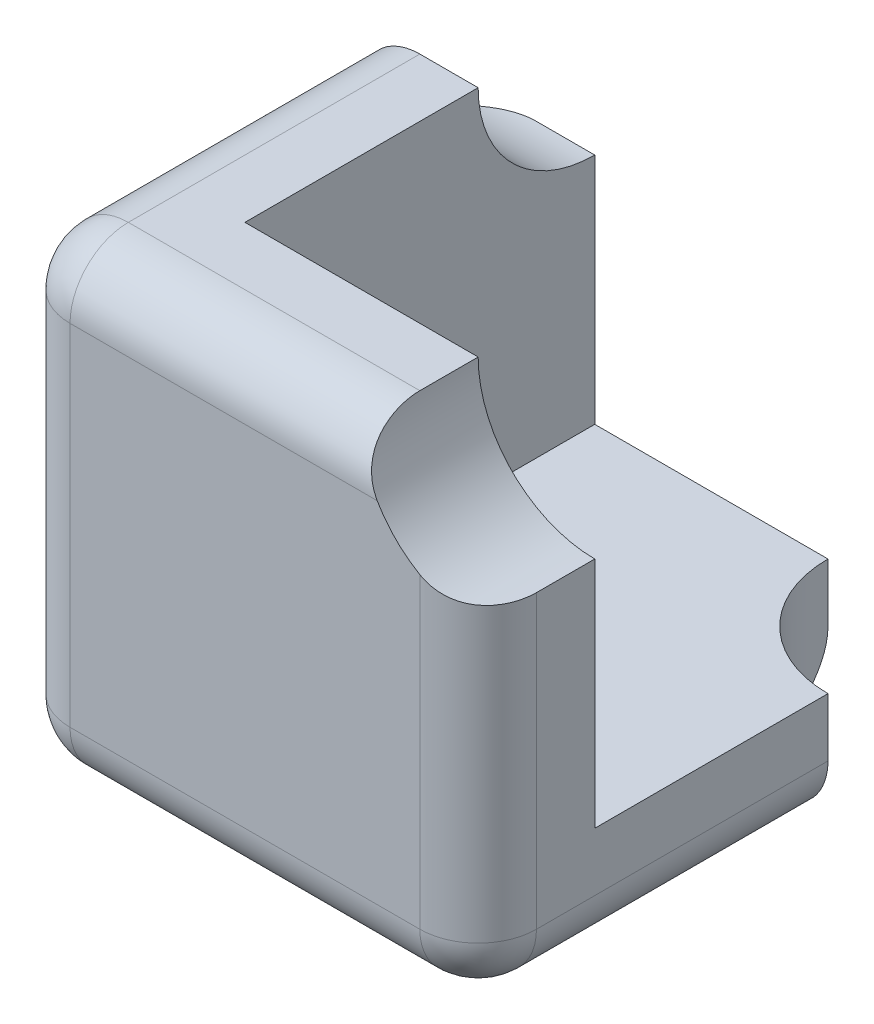
ISO-10303-21;
HEADER;
FILE_DESCRIPTION(('STEP AP214'),'2;1');
FILE_NAME('part.step','',(''),(''),'','','');
FILE_SCHEMA(('AUTOMOTIVE_DESIGN { 1 0 10303 214 1 1 1 1 }'));
ENDSEC;
DATA;
#1=APPLICATION_CONTEXT('core data for automotive mechanical design processes');
#2=APPLICATION_PROTOCOL_DEFINITION('international standard','automotive_design',2000,#1);
#3=PRODUCT_CONTEXT('',#1,'mechanical');
#4=PRODUCT('Part','Part','',(#3));
#5=PRODUCT_RELATED_PRODUCT_CATEGORY('part','',(#4));
#6=PRODUCT_DEFINITION_FORMATION('','',#4);
#7=PRODUCT_DEFINITION_CONTEXT('part definition',#1,'design');
#8=PRODUCT_DEFINITION('design','',#6,#7);
#9=PRODUCT_DEFINITION_SHAPE('','',#8);
#10=(LENGTH_UNIT() NAMED_UNIT(*) SI_UNIT(.MILLI.,.METRE.));
#11=(NAMED_UNIT(*) PLANE_ANGLE_UNIT() SI_UNIT($,.RADIAN.));
#12=(NAMED_UNIT(*) SI_UNIT($,.STERADIAN.) SOLID_ANGLE_UNIT());
#13=UNCERTAINTY_MEASURE_WITH_UNIT(LENGTH_MEASURE(1.E-05),#10,'distance_accuracy_value','');
#14=(GEOMETRIC_REPRESENTATION_CONTEXT(3) GLOBAL_UNCERTAINTY_ASSIGNED_CONTEXT((#13)) GLOBAL_UNIT_ASSIGNED_CONTEXT((#10,
#11,#12)) REPRESENTATION_CONTEXT('',''));
#15=CARTESIAN_POINT('',(0.,0.,0.));
#16=DIRECTION('',(0.,0.,1.));
#17=DIRECTION('',(1.,0.,0.));
#18=AXIS2_PLACEMENT_3D('',#15,#16,#17);
#19=CARTESIAN_POINT('',(0.,5.,0.));
#20=DIRECTION('',(0.,-1.,0.));
#21=DIRECTION('',(0.,0.,-1.));
#22=AXIS2_PLACEMENT_3D('',#19,#20,#21);
#23=PLANE('',#22);
#24=DIRECTION('',(0.,0.,-1.));
#25=VECTOR('',#24,1.);
#26=CARTESIAN_POINT('',(5.,5.,0.));
#27=LINE('',#26,#25);
#28=CARTESIAN_POINT('',(5.,5.,-5.));
#29=VERTEX_POINT('',#28);
#30=CARTESIAN_POINT('',(5.,5.,-20.));
#31=VERTEX_POINT('',#30);
#32=EDGE_CURVE('E161',#29,#31,#27,.T.);
#33=ORIENTED_EDGE('',*,*,#32,.F.);
#34=DIRECTION('',(1.,0.,0.));
#35=VECTOR('',#34,1.);
#36=CARTESIAN_POINT('',(0.,5.,-5.));
#37=LINE('',#36,#35);
#38=CARTESIAN_POINT('',(20.,5.,-5.));
#39=VERTEX_POINT('',#38);
#40=EDGE_CURVE('E238',#29,#39,#37,.T.);
#41=ORIENTED_EDGE('',*,*,#40,.T.);
#42=DIRECTION('',(0.,0.,-1.));
#43=VECTOR('',#42,1.);
#44=CARTESIAN_POINT('',(20.,5.,0.));
#45=LINE('',#44,#43);
#46=CARTESIAN_POINT('',(20.,5.,-15.));
#47=VERTEX_POINT('',#46);
#48=EDGE_CURVE('E241',#39,#47,#45,.T.);
#49=ORIENTED_EDGE('',*,*,#48,.T.);
#50=CARTESIAN_POINT('',(20.,5.,-20.));
#51=DIRECTION('',(0.,-1.,0.));
#52=DIRECTION('',(0.,0.,-1.));
#53=AXIS2_PLACEMENT_3D('',#50,#51,#52);
#54=CIRCLE('',#53,5.);
#55=CARTESIAN_POINT('',(15.,5.,-20.));
#56=VERTEX_POINT('',#55);
#57=EDGE_CURVE('E428',#47,#56,#54,.T.);
#58=ORIENTED_EDGE('',*,*,#57,.T.);
#59=DIRECTION('',(-1.,0.,0.));
#60=VECTOR('',#59,1.);
#61=CARTESIAN_POINT('',(0.,5.,-20.));
#62=LINE('',#61,#60);
#63=EDGE_CURVE('E250',#56,#31,#62,.T.);
#64=ORIENTED_EDGE('',*,*,#63,.T.);
#65=EDGE_LOOP('',(#33,#41,#49,#58,#64));
#66=FACE_BOUND('',#65,.T.);
#67=ADVANCED_FACE('F35',(#66),#23,.F.);
#68=CARTESIAN_POINT('',(0.,0.,-5.));
#69=DIRECTION('',(0.,0.,-1.));
#70=DIRECTION('',(-1.,0.,0.));
#71=AXIS2_PLACEMENT_3D('',#68,#69,#70);
#72=PLANE('',#71);
#73=ORIENTED_EDGE('',*,*,#40,.F.);
#74=DIRECTION('',(0.,1.,0.));
#75=VECTOR('',#74,1.);
#76=CARTESIAN_POINT('',(5.,0.,-5.));
#77=LINE('',#76,#75);
#78=CARTESIAN_POINT('',(5.,20.,-5.));
#79=VERTEX_POINT('',#78);
#80=EDGE_CURVE('E176',#29,#79,#77,.T.);
#81=ORIENTED_EDGE('',*,*,#80,.T.);
#82=DIRECTION('',(-1.,0.,0.));
#83=VECTOR('',#82,1.);
#84=CARTESIAN_POINT('',(0.,20.,-5.));
#85=LINE('',#84,#83);
#86=CARTESIAN_POINT('',(15.,20.,-5.));
#87=VERTEX_POINT('',#86);
#88=EDGE_CURVE('E244',#87,#79,#85,.T.);
#89=ORIENTED_EDGE('',*,*,#88,.F.);
#90=CARTESIAN_POINT('',(20.,20.,-5.));
#91=DIRECTION('',(0.,0.,-1.));
#92=DIRECTION('',(-1.,0.,0.));
#93=AXIS2_PLACEMENT_3D('',#90,#91,#92);
#94=CIRCLE('',#93,5.);
#95=CARTESIAN_POINT('',(20.,15.,-5.));
#96=VERTEX_POINT('',#95);
#97=EDGE_CURVE('E11',#87,#96,#94,.F.);
#98=ORIENTED_EDGE('',*,*,#97,.T.);
#99=DIRECTION('',(0.,1.,0.));
#100=VECTOR('',#99,1.);
#101=CARTESIAN_POINT('',(20.,0.,-5.));
#102=LINE('',#101,#100);
#103=EDGE_CURVE('E455',#39,#96,#102,.T.);
#104=ORIENTED_EDGE('',*,*,#103,.F.);
#105=EDGE_LOOP('',(#73,#81,#89,#98,#104));
#106=FACE_BOUND('',#105,.T.);
#107=ADVANCED_FACE('F356',(#106),#72,.T.);
#108=CARTESIAN_POINT('',(0.,5.,0.));
#109=DIRECTION('',(1.,0.,0.));
#110=DIRECTION('',(0.,0.,-1.));
#111=AXIS2_PLACEMENT_3D('',#108,#109,#110);
#112=PLANE('',#111);
#113=DIRECTION('',(0.,-1.,0.));
#114=VECTOR('',#113,1.);
#115=CARTESIAN_POINT('',(0.,5.,-2.5));
#116=LINE('',#115,#114);
#117=CARTESIAN_POINT('',(0.,2.5,-2.5));
#118=VERTEX_POINT('',#117);
#119=CARTESIAN_POINT('',(0.,17.5,-2.5));
#120=VERTEX_POINT('',#119);
#121=EDGE_CURVE('E258',#118,#120,#116,.F.);
#122=ORIENTED_EDGE('',*,*,#121,.T.);
#123=DIRECTION('',(0.,0.,1.));
#124=VECTOR('',#123,1.);
#125=CARTESIAN_POINT('',(0.,17.5,-15.));
#126=LINE('',#125,#124);
#127=CARTESIAN_POINT('',(0.,17.5,-15.6698729810778));
#128=VERTEX_POINT('',#127);
#129=EDGE_CURVE('E296',#120,#128,#126,.F.);
#130=ORIENTED_EDGE('',*,*,#129,.T.);
#131=CARTESIAN_POINT('',(0.,20.,-20.));
#132=DIRECTION('',(1.,0.,0.));
#133=DIRECTION('',(0.,0.,-1.));
#134=AXIS2_PLACEMENT_3D('',#131,#132,#133);
#135=CIRCLE('',#134,5.);
#136=CARTESIAN_POINT('',(0.,15.6698729810778,-17.5));
#137=VERTEX_POINT('',#136);
#138=EDGE_CURVE('E187',#128,#137,#135,.T.);
#139=ORIENTED_EDGE('',*,*,#138,.T.);
#140=DIRECTION('',(0.,-1.,0.));
#141=VECTOR('',#140,1.);
#142=CARTESIAN_POINT('',(0.,5.,-17.5));
#143=LINE('',#142,#141);
#144=CARTESIAN_POINT('',(0.,2.5,-17.5));
#145=VERTEX_POINT('',#144);
#146=EDGE_CURVE('E294',#137,#145,#143,.T.);
#147=ORIENTED_EDGE('',*,*,#146,.T.);
#148=DIRECTION('',(0.,0.,1.));
#149=VECTOR('',#148,1.);
#150=CARTESIAN_POINT('',(0.,2.5,0.));
#151=LINE('',#150,#149);
#152=EDGE_CURVE('E261',#145,#118,#151,.T.);
#153=ORIENTED_EDGE('',*,*,#152,.T.);
#154=EDGE_LOOP('',(#122,#130,#139,#147,#153));
#155=FACE_BOUND('',#154,.T.);
#156=ADVANCED_FACE('F363',(#155),#112,.F.);
#157=CARTESIAN_POINT('',(0.,5.,0.));
#158=DIRECTION('',(0.,0.,-1.));
#159=DIRECTION('',(-1.,0.,0.));
#160=AXIS2_PLACEMENT_3D('',#157,#158,#159);
#161=PLANE('',#160);
#162=DIRECTION('',(1.,0.,0.));
#163=VECTOR('',#162,1.);
#164=CARTESIAN_POINT('',(20.,2.5,0.));
#165=LINE('',#164,#163);
#166=CARTESIAN_POINT('',(2.5,2.5,0.));
#167=VERTEX_POINT('',#166);
#168=CARTESIAN_POINT('',(17.5,2.5,0.));
#169=VERTEX_POINT('',#168);
#170=EDGE_CURVE('E268',#167,#169,#165,.T.);
#171=ORIENTED_EDGE('',*,*,#170,.T.);
#172=DIRECTION('',(0.,-1.,0.));
#173=VECTOR('',#172,1.);
#174=CARTESIAN_POINT('',(17.5,5.,0.));
#175=LINE('',#174,#173);
#176=CARTESIAN_POINT('',(17.5,15.6698729810778,0.));
#177=VERTEX_POINT('',#176);
#178=EDGE_CURVE('E58',#169,#177,#175,.F.);
#179=ORIENTED_EDGE('',*,*,#178,.T.);
#180=CARTESIAN_POINT('',(20.,20.,0.));
#181=DIRECTION('',(0.,0.,-1.));
#182=DIRECTION('',(-1.,0.,0.));
#183=AXIS2_PLACEMENT_3D('',#180,#181,#182);
#184=CIRCLE('',#183,5.);
#185=CARTESIAN_POINT('',(15.6698729810778,17.5,0.));
#186=VERTEX_POINT('',#185);
#187=EDGE_CURVE('E185',#177,#186,#184,.T.);
#188=ORIENTED_EDGE('',*,*,#187,.T.);
#189=DIRECTION('',(-1.,0.,0.));
#190=VECTOR('',#189,1.);
#191=CARTESIAN_POINT('',(2.5,17.5,0.));
#192=LINE('',#191,#190);
#193=CARTESIAN_POINT('',(2.5,17.5,0.));
#194=VERTEX_POINT('',#193);
#195=EDGE_CURVE('E51',#186,#194,#192,.T.);
#196=ORIENTED_EDGE('',*,*,#195,.T.);
#197=DIRECTION('',(0.,-1.,0.));
#198=VECTOR('',#197,1.);
#199=CARTESIAN_POINT('',(2.5,5.,0.));
#200=LINE('',#199,#198);
#201=EDGE_CURVE('E270',#194,#167,#200,.T.);
#202=ORIENTED_EDGE('',*,*,#201,.T.);
#203=EDGE_LOOP('',(#171,#179,#188,#196,#202));
#204=FACE_BOUND('',#203,.T.);
#205=ADVANCED_FACE('F228',(#204),#161,.F.);
#206=CARTESIAN_POINT('',(20.,5.,0.));
#207=DIRECTION('',(-1.,0.,0.));
#208=DIRECTION('',(0.,0.,1.));
#209=AXIS2_PLACEMENT_3D('',#206,#207,#208);
#210=PLANE('',#209);
#211=DIRECTION('',(0.,-1.,0.));
#212=VECTOR('',#211,1.);
#213=CARTESIAN_POINT('',(20.,5.,-2.5));
#214=LINE('',#213,#212);
#215=CARTESIAN_POINT('',(20.,15.,-2.5));
#216=VERTEX_POINT('',#215);
#217=CARTESIAN_POINT('',(20.,2.5,-2.5));
#218=VERTEX_POINT('',#217);
#219=EDGE_CURVE('E305',#216,#218,#214,.T.);
#220=ORIENTED_EDGE('',*,*,#219,.T.);
#221=DIRECTION('',(0.,0.,-1.));
#222=VECTOR('',#221,1.);
#223=CARTESIAN_POINT('',(20.,2.5,-15.));
#224=LINE('',#223,#222);
#225=CARTESIAN_POINT('',(20.,2.5,-15.));
#226=VERTEX_POINT('',#225);
#227=EDGE_CURVE('E307',#218,#226,#224,.T.);
#228=ORIENTED_EDGE('',*,*,#227,.T.);
#229=DIRECTION('',(0.,-1.,0.));
#230=VECTOR('',#229,1.);
#231=CARTESIAN_POINT('',(20.,5.,-15.));
#232=LINE('',#231,#230);
#233=EDGE_CURVE('E255',#47,#226,#232,.T.);
#234=ORIENTED_EDGE('',*,*,#233,.F.);
#235=ORIENTED_EDGE('',*,*,#48,.F.);
#236=ORIENTED_EDGE('',*,*,#103,.T.);
#237=DIRECTION('',(0.,0.,1.));
#238=VECTOR('',#237,1.);
#239=CARTESIAN_POINT('',(20.,15.,-5.));
#240=LINE('',#239,#238);
#241=EDGE_CURVE('E239',#96,#216,#240,.T.);
#242=ORIENTED_EDGE('',*,*,#241,.T.);
#243=EDGE_LOOP('',(#220,#228,#234,#235,#236,#242));
#244=FACE_BOUND('',#243,.T.);
#245=ADVANCED_FACE('F375',(#244),#210,.F.);
#246=CARTESIAN_POINT('',(0.,5.,-20.));
#247=DIRECTION('',(0.,0.,1.));
#248=DIRECTION('',(1.,0.,0.));
#249=AXIS2_PLACEMENT_3D('',#246,#247,#248);
#250=PLANE('',#249);
#251=DIRECTION('',(-1.,0.,0.));
#252=VECTOR('',#251,1.);
#253=CARTESIAN_POINT('',(2.5,2.5,-20.));
#254=LINE('',#253,#252);
#255=CARTESIAN_POINT('',(15.,2.5,-20.));
#256=VERTEX_POINT('',#255);
#257=CARTESIAN_POINT('',(2.5,2.5,-20.));
#258=VERTEX_POINT('',#257);
#259=EDGE_CURVE('E298',#256,#258,#254,.T.);
#260=ORIENTED_EDGE('',*,*,#259,.T.);
#261=DIRECTION('',(0.,-1.,0.));
#262=VECTOR('',#261,1.);
#263=CARTESIAN_POINT('',(2.5,5.,-20.));
#264=LINE('',#263,#262);
#265=CARTESIAN_POINT('',(2.5,15.,-20.));
#266=VERTEX_POINT('',#265);
#267=EDGE_CURVE('E173',#258,#266,#264,.F.);
#268=ORIENTED_EDGE('',*,*,#267,.T.);
#269=DIRECTION('',(-1.,0.,0.));
#270=VECTOR('',#269,1.);
#271=CARTESIAN_POINT('',(5.,15.,-20.));
#272=LINE('',#271,#270);
#273=CARTESIAN_POINT('',(5.,15.,-20.));
#274=VERTEX_POINT('',#273);
#275=EDGE_CURVE('E170',#274,#266,#272,.T.);
#276=ORIENTED_EDGE('',*,*,#275,.F.);
#277=DIRECTION('',(0.,1.,0.));
#278=VECTOR('',#277,1.);
#279=CARTESIAN_POINT('',(5.,0.,-20.));
#280=LINE('',#279,#278);
#281=EDGE_CURVE('E154',#31,#274,#280,.T.);
#282=ORIENTED_EDGE('',*,*,#281,.F.);
#283=ORIENTED_EDGE('',*,*,#63,.F.);
#284=DIRECTION('',(0.,-1.,0.));
#285=VECTOR('',#284,1.);
#286=CARTESIAN_POINT('',(15.,5.,-20.));
#287=LINE('',#286,#285);
#288=EDGE_CURVE('E252',#56,#256,#287,.T.);
#289=ORIENTED_EDGE('',*,*,#288,.T.);
#290=EDGE_LOOP('',(#260,#268,#276,#282,#283,#289));
#291=FACE_BOUND('',#290,.T.);
#292=ADVANCED_FACE('F171',(#291),#250,.F.);
#293=CARTESIAN_POINT('',(0.,0.,0.));
#294=DIRECTION('',(0.,-1.,0.));
#295=DIRECTION('',(0.,0.,-1.));
#296=AXIS2_PLACEMENT_3D('',#293,#294,#295);
#297=PLANE('',#296);
#298=DIRECTION('',(0.,0.,1.));
#299=VECTOR('',#298,1.);
#300=CARTESIAN_POINT('',(2.5,0.,-20.));
#301=LINE('',#300,#299);
#302=CARTESIAN_POINT('',(2.5,0.,-2.5));
#303=VERTEX_POINT('',#302);
#304=CARTESIAN_POINT('',(2.5,0.,-17.5));
#305=VERTEX_POINT('',#304);
#306=EDGE_CURVE('E265',#303,#305,#301,.F.);
#307=ORIENTED_EDGE('',*,*,#306,.T.);
#308=DIRECTION('',(-1.,0.,0.));
#309=VECTOR('',#308,1.);
#310=CARTESIAN_POINT('',(15.,0.,-17.5));
#311=LINE('',#310,#309);
#312=CARTESIAN_POINT('',(15.6698729810778,0.,-17.5));
#313=VERTEX_POINT('',#312);
#314=EDGE_CURVE('E303',#305,#313,#311,.F.);
#315=ORIENTED_EDGE('',*,*,#314,.T.);
#316=CARTESIAN_POINT('',(20.,0.,-20.));
#317=DIRECTION('',(0.,-1.,0.));
#318=DIRECTION('',(0.,0.,-1.));
#319=AXIS2_PLACEMENT_3D('',#316,#317,#318);
#320=CIRCLE('',#319,5.);
#321=CARTESIAN_POINT('',(17.5,0.,-15.6698729810778));
#322=VERTEX_POINT('',#321);
#323=EDGE_CURVE('E333',#313,#322,#320,.F.);
#324=ORIENTED_EDGE('',*,*,#323,.T.);
#325=DIRECTION('',(0.,0.,-1.));
#326=VECTOR('',#325,1.);
#327=CARTESIAN_POINT('',(17.5,0.,-2.5));
#328=LINE('',#327,#326);
#329=CARTESIAN_POINT('',(17.5,0.,-2.5));
#330=VERTEX_POINT('',#329);
#331=EDGE_CURVE('E301',#322,#330,#328,.F.);
#332=ORIENTED_EDGE('',*,*,#331,.T.);
#333=DIRECTION('',(1.,0.,0.));
#334=VECTOR('',#333,1.);
#335=CARTESIAN_POINT('',(0.,0.,-2.5));
#336=LINE('',#335,#334);
#337=EDGE_CURVE('E263',#330,#303,#336,.F.);
#338=ORIENTED_EDGE('',*,*,#337,.T.);
#339=EDGE_LOOP('',(#307,#315,#324,#332,#338));
#340=FACE_BOUND('',#339,.T.);
#341=ADVANCED_FACE('F369',(#340),#297,.T.);
#342=CARTESIAN_POINT('',(0.,20.,-5.));
#343=DIRECTION('',(0.,1.,0.));
#344=DIRECTION('',(-1.,0.,0.));
#345=AXIS2_PLACEMENT_3D('',#342,#343,#344);
#346=PLANE('',#345);
#347=DIRECTION('',(-1.,0.,0.));
#348=VECTOR('',#347,1.);
#349=CARTESIAN_POINT('',(5.,20.,-15.));
#350=LINE('',#349,#348);
#351=CARTESIAN_POINT('',(5.,20.,-15.));
#352=VERTEX_POINT('',#351);
#353=CARTESIAN_POINT('',(2.5,20.,-15.));
#354=VERTEX_POINT('',#353);
#355=EDGE_CURVE('E177',#352,#354,#350,.T.);
#356=ORIENTED_EDGE('',*,*,#355,.T.);
#357=DIRECTION('',(0.,0.,1.));
#358=VECTOR('',#357,1.);
#359=CARTESIAN_POINT('',(2.5,20.,-2.5));
#360=LINE('',#359,#358);
#361=CARTESIAN_POINT('',(2.5,20.,-2.5));
#362=VERTEX_POINT('',#361);
#363=EDGE_CURVE('E292',#354,#362,#360,.T.);
#364=ORIENTED_EDGE('',*,*,#363,.T.);
#365=DIRECTION('',(-1.,0.,0.));
#366=VECTOR('',#365,1.);
#367=CARTESIAN_POINT('',(15.,20.,-2.5));
#368=LINE('',#367,#366);
#369=CARTESIAN_POINT('',(15.,20.,-2.5));
#370=VERTEX_POINT('',#369);
#371=EDGE_CURVE('E290',#362,#370,#368,.F.);
#372=ORIENTED_EDGE('',*,*,#371,.T.);
#373=DIRECTION('',(0.,0.,1.));
#374=VECTOR('',#373,1.);
#375=CARTESIAN_POINT('',(15.,20.,-5.));
#376=LINE('',#375,#374);
#377=EDGE_CURVE('E233',#87,#370,#376,.T.);
#378=ORIENTED_EDGE('',*,*,#377,.F.);
#379=ORIENTED_EDGE('',*,*,#88,.T.);
#380=DIRECTION('',(0.,0.,1.));
#381=VECTOR('',#380,1.);
#382=CARTESIAN_POINT('',(5.,20.,0.));
#383=LINE('',#382,#381);
#384=EDGE_CURVE('E165',#352,#79,#383,.T.);
#385=ORIENTED_EDGE('',*,*,#384,.F.);
#386=EDGE_LOOP('',(#356,#364,#372,#378,#379,#385));
#387=FACE_BOUND('',#386,.T.);
#388=ADVANCED_FACE('F368',(#387),#346,.T.);
#389=CARTESIAN_POINT('',(5.,0.,0.));
#390=DIRECTION('',(-1.,0.,0.));
#391=DIRECTION('',(0.,0.,1.));
#392=AXIS2_PLACEMENT_3D('',#389,#390,#391);
#393=PLANE('',#392);
#394=ORIENTED_EDGE('',*,*,#80,.F.);
#395=ORIENTED_EDGE('',*,*,#32,.T.);
#396=ORIENTED_EDGE('',*,*,#281,.T.);
#397=CARTESIAN_POINT('',(5.,20.,-20.));
#398=DIRECTION('',(-1.,0.,0.));
#399=DIRECTION('',(0.,0.,1.));
#400=AXIS2_PLACEMENT_3D('',#397,#398,#399);
#401=CIRCLE('',#400,5.);
#402=EDGE_CURVE('E158',#274,#352,#401,.T.);
#403=ORIENTED_EDGE('',*,*,#402,.T.);
#404=ORIENTED_EDGE('',*,*,#384,.T.);
#405=EDGE_LOOP('',(#394,#395,#396,#403,#404));
#406=FACE_BOUND('',#405,.T.);
#407=ADVANCED_FACE('F156',(#406),#393,.F.);
#408=CARTESIAN_POINT('',(2.5,5.,-2.5));
#409=DIRECTION('',(0.,-1.,0.));
#410=DIRECTION('',(0.,0.,-1.));
#411=AXIS2_PLACEMENT_3D('',#408,#409,#410);
#412=CYLINDRICAL_SURFACE('',#411,2.5);
#413=ORIENTED_EDGE('',*,*,#201,.F.);
#414=CARTESIAN_POINT('',(2.5,17.5,-2.5));
#415=DIRECTION('',(0.,-1.,0.));
#416=DIRECTION('',(0.,0.,-1.));
#417=AXIS2_PLACEMENT_3D('',#414,#415,#416);
#418=CIRCLE('',#417,2.5);
#419=EDGE_CURVE('E287',#194,#120,#418,.T.);
#420=ORIENTED_EDGE('',*,*,#419,.T.);
#421=ORIENTED_EDGE('',*,*,#121,.F.);
#422=CARTESIAN_POINT('',(2.5,2.5,-2.5));
#423=DIRECTION('',(0.,-1.,0.));
#424=DIRECTION('',(0.,0.,-1.));
#425=AXIS2_PLACEMENT_3D('',#422,#423,#424);
#426=CIRCLE('',#425,2.5);
#427=EDGE_CURVE('E166',#167,#118,#426,.T.);
#428=ORIENTED_EDGE('',*,*,#427,.F.);
#429=EDGE_LOOP('',(#413,#420,#421,#428));
#430=FACE_BOUND('',#429,.T.);
#431=ADVANCED_FACE('F394',(#430),#412,.T.);
#432=CARTESIAN_POINT('',(0.,2.5,-2.5));
#433=DIRECTION('',(-1.,0.,0.));
#434=DIRECTION('',(0.,0.,1.));
#435=AXIS2_PLACEMENT_3D('',#432,#433,#434);
#436=CYLINDRICAL_SURFACE('',#435,2.5);
#437=ORIENTED_EDGE('',*,*,#337,.F.);
#438=CARTESIAN_POINT('',(17.5,2.5,-2.5));
#439=DIRECTION('',(-1.,0.,0.));
#440=DIRECTION('',(0.,0.,1.));
#441=AXIS2_PLACEMENT_3D('',#438,#439,#440);
#442=CIRCLE('',#441,2.5);
#443=EDGE_CURVE('E284',#330,#169,#442,.T.);
#444=ORIENTED_EDGE('',*,*,#443,.T.);
#445=ORIENTED_EDGE('',*,*,#170,.F.);
#446=CARTESIAN_POINT('',(2.5,2.5,-2.5));
#447=DIRECTION('',(-1.,0.,0.));
#448=DIRECTION('',(0.,0.,1.));
#449=AXIS2_PLACEMENT_3D('',#446,#447,#448);
#450=CIRCLE('',#449,2.5);
#451=EDGE_CURVE('E276',#303,#167,#450,.T.);
#452=ORIENTED_EDGE('',*,*,#451,.F.);
#453=EDGE_LOOP('',(#437,#444,#445,#452));
#454=FACE_BOUND('',#453,.T.);
#455=ADVANCED_FACE('F390',(#454),#436,.T.);
#456=CARTESIAN_POINT('',(2.5,2.5,-2.5));
#457=DIRECTION('',(0.,0.,1.));
#458=DIRECTION('',(1.,0.,0.));
#459=AXIS2_PLACEMENT_3D('',#456,#457,#458);
#460=SPHERICAL_SURFACE('',#459,2.5);
#461=ORIENTED_EDGE('',*,*,#451,.T.);
#462=ORIENTED_EDGE('',*,*,#427,.T.);
#463=CARTESIAN_POINT('',(2.5,2.5,-2.5));
#464=DIRECTION('',(0.,0.,1.));
#465=DIRECTION('',(1.,0.,0.));
#466=AXIS2_PLACEMENT_3D('',#463,#464,#465);
#467=CIRCLE('',#466,2.5);
#468=EDGE_CURVE('E273',#303,#118,#467,.F.);
#469=ORIENTED_EDGE('',*,*,#468,.F.);
#470=EDGE_LOOP('',(#461,#462,#469));
#471=FACE_BOUND('',#470,.T.);
#472=ADVANCED_FACE('F386',(#471),#460,.T.);
#473=CARTESIAN_POINT('',(2.5,2.5,0.));
#474=DIRECTION('',(0.,0.,-1.));
#475=DIRECTION('',(-1.,0.,0.));
#476=AXIS2_PLACEMENT_3D('',#473,#474,#475);
#477=CYLINDRICAL_SURFACE('',#476,2.5);
#478=ORIENTED_EDGE('',*,*,#152,.F.);
#479=CARTESIAN_POINT('',(2.5,2.5,-17.5));
#480=DIRECTION('',(0.,0.,-1.));
#481=DIRECTION('',(-1.,0.,0.));
#482=AXIS2_PLACEMENT_3D('',#479,#480,#481);
#483=CIRCLE('',#482,2.5);
#484=EDGE_CURVE('E272',#145,#305,#483,.F.);
#485=ORIENTED_EDGE('',*,*,#484,.T.);
#486=ORIENTED_EDGE('',*,*,#306,.F.);
#487=ORIENTED_EDGE('',*,*,#468,.T.);
#488=EDGE_LOOP('',(#478,#485,#486,#487));
#489=FACE_BOUND('',#488,.T.);
#490=ADVANCED_FACE('F340',(#489),#477,.T.);
#491=CARTESIAN_POINT('',(0.,2.5,-17.5));
#492=DIRECTION('',(1.,0.,0.));
#493=DIRECTION('',(0.,0.,-1.));
#494=AXIS2_PLACEMENT_3D('',#491,#492,#493);
#495=CYLINDRICAL_SURFACE('',#494,2.5);
#496=ORIENTED_EDGE('',*,*,#259,.F.);
#497=CARTESIAN_POINT('',(15.,2.5,-20.));
#498=CARTESIAN_POINT('',(15.0000109379574,2.42985791248536,-20.0000066505724));
#499=CARTESIAN_POINT('',(15.0000002839852,2.35971902963168,-19.9970480679935));
#500=CARTESIAN_POINT('',(15.0000153800858,2.21993990745193,-19.985251942188));
#501=CARTESIAN_POINT('',(15.000041128794,2.15029964953224,-19.9764146193444));
#502=CARTESIAN_POINT('',(15.000208581645,2.01202565452811,-19.9529160760321));
#503=CARTESIAN_POINT('',(15.0003502506114,1.94339161853341,-19.9382566229987));
#504=CARTESIAN_POINT('',(15.0009061078249,1.80761685770617,-19.9032328351533));
#505=CARTESIAN_POINT('',(15.0013202926878,1.74047611434032,-19.8828685711865));
#506=CARTESIAN_POINT('',(15.0032654233591,1.54192231934507,-19.8133764694427));
#507=CARTESIAN_POINT('',(15.0054987926733,1.4133407104619,-19.7558430021091));
#508=CARTESIAN_POINT('',(15.0139904413967,1.16781113607776,-19.6201338721212));
#509=CARTESIAN_POINT('',(15.0202480767905,1.05086131256458,-19.54196151355));
#510=CARTESIAN_POINT('',(15.0393028610168,0.833106693234527,-19.3683258206021));
#511=CARTESIAN_POINT('',(15.0520322774172,0.732148605198733,-19.2730480591565));
#512=CARTESIAN_POINT('',(15.086518516894,0.548067817717907,-19.068090993172));
#513=CARTESIAN_POINT('',(15.1082681838505,0.464931059041353,-18.9584231518931));
#514=CARTESIAN_POINT('',(15.1616960263138,0.321678581040619,-18.7336712537516));
#515=CARTESIAN_POINT('',(15.1929306162739,0.260758813554477,-18.6189935586305));
#516=CARTESIAN_POINT('',(15.2665576278945,0.15822210636634,-18.3845693204874));
#517=CARTESIAN_POINT('',(15.3089613415465,0.116624819993922,-18.2648177511772));
#518=CARTESIAN_POINT('',(15.4004470917657,0.0554988297406859,-18.0358512399201));
#519=CARTESIAN_POINT('',(15.4485462496494,0.0342824077665238,-17.9266881399622));
#520=CARTESIAN_POINT('',(15.5270048452609,0.0134723133130108,-17.764844362921));
#521=CARTESIAN_POINT('',(15.5541880751041,0.00837109750552332,-17.711250185113));
#522=CARTESIAN_POINT('',(15.6105542707831,0.00163554093701271,-17.6049242220446));
#523=CARTESIAN_POINT('',(15.6397365312745,-1.62198832462524E-08,-17.5521921406513));
#524=CARTESIAN_POINT('',(15.6698729810778,0.,-17.5));
#525=B_SPLINE_CURVE_WITH_KNOTS('',3,(#497,#498,#499,#500,#501,#502,#503,#504,#505,#506,#507,
#508,#509,#510,#511,#512,#513,#514,#515,#516,#517,#518,#519,#520,#521,#522,#523,#524),
.UNSPECIFIED.,.F.,.F.,(4,2,2,2,2,2,2,2,2,2,2,2,2,4),(0.,0.210358093154529,0.420708300817165,
0.630994700804921,0.841278489461558,1.2617348979415,1.68212403626242,2.09820135027111,
2.5139492032876,2.91265297377238,3.3117613916068,3.67388863562652,3.85469872909178,
4.03544535032012),.UNSPECIFIED.);
#526=EDGE_CURVE('E312',#256,#313,#525,.T.);
#527=ORIENTED_EDGE('',*,*,#526,.T.);
#528=ORIENTED_EDGE('',*,*,#314,.F.);
#529=CARTESIAN_POINT('',(2.5,2.5,-17.5));
#530=DIRECTION('',(-1.,0.,0.));
#531=DIRECTION('',(0.,0.,1.));
#532=AXIS2_PLACEMENT_3D('',#529,#530,#531);
#533=CIRCLE('',#532,2.5);
#534=EDGE_CURVE('E277',#258,#305,#533,.T.);
#535=ORIENTED_EDGE('',*,*,#534,.F.);
#536=EDGE_LOOP('',(#496,#527,#528,#535));
#537=FACE_BOUND('',#536,.T.);
#538=ADVANCED_FACE('F336',(#537),#495,.T.);
#539=CARTESIAN_POINT('',(2.5,5.,-17.5));
#540=DIRECTION('',(0.,-1.,0.));
#541=DIRECTION('',(0.,0.,-1.));
#542=AXIS2_PLACEMENT_3D('',#539,#540,#541);
#543=CYLINDRICAL_SURFACE('',#542,2.5);
#544=ORIENTED_EDGE('',*,*,#146,.F.);
#545=CARTESIAN_POINT('',(0.,15.6698729810778,-17.5));
#546=CARTESIAN_POINT('',(-6.25355947853577E-06,15.6350966667159,-17.5602133268523));
#547=CARTESIAN_POINT('',(0.0021759294497264,15.6015859026659,-17.6211774865921));
#548=CARTESIAN_POINT('',(0.0111927667226448,15.5372420717791,-17.7442103071462));
#549=CARTESIAN_POINT('',(0.0180302867308789,15.5064106675,-17.8062796253438));
#550=CARTESIAN_POINT('',(0.0366466763814834,15.4475756033325,-17.931134818236));
#551=CARTESIAN_POINT('',(0.0484322258380407,15.4195758297758,-17.9939215495517));
#552=CARTESIAN_POINT('',(0.0771273434378325,15.3665793125579,-18.1195552054964));
#553=CARTESIAN_POINT('',(0.0940357796737405,15.3415819072223,-18.1824021137746));
#554=CARTESIAN_POINT('',(0.152845410336155,15.271011085454,-18.3707113198535));
#555=CARTESIAN_POINT('',(0.202774517287871,15.2300458755616,-18.4955411756482));
#556=CARTESIAN_POINT('',(0.323752716128591,15.1602776488443,-18.7378511752582));
#557=CARTESIAN_POINT('',(0.394769246431604,15.1314560455644,-18.8553423148639));
#558=CARTESIAN_POINT('',(0.551572332695673,15.0857462617573,-19.0717583663878));
#559=CARTESIAN_POINT('',(0.636239187675258,15.0682539463749,-19.1713699143032));
#560=CARTESIAN_POINT('',(0.820749063546572,15.0406725818775,-19.3566703006184));
#561=CARTESIAN_POINT('',(0.920601655773737,15.0305882254218,-19.4423502871976));
#562=CARTESIAN_POINT('',(1.13448695049846,15.0155279103089,-19.5983800955805));
#563=CARTESIAN_POINT('',(1.24872580805788,15.0106386700146,-19.6684546965166));
#564=CARTESIAN_POINT('',(1.48705563625861,15.0040630706679,-19.7894948693179));
#565=CARTESIAN_POINT('',(1.61114674820529,15.002376757562,-19.8404601670491));
#566=CARTESIAN_POINT('',(1.79982599137493,15.0009467235715,-19.9008193114302));
#567=CARTESIAN_POINT('',(1.86199829414766,15.0006493846213,-19.9180814069978));
#568=CARTESIAN_POINT('',(1.98750547515129,15.0002506569418,-19.9477544331602));
#569=CARTESIAN_POINT('',(2.05084033056475,15.0001492643708,-19.9601654588607));
#570=CARTESIAN_POINT('',(2.17828417592748,15.0000294333075,-19.9800522462266));
#571=CARTESIAN_POINT('',(2.24239325983819,15.0000110049874,-19.9875274026127));
#572=CARTESIAN_POINT('',(2.37100071065781,15.0000001981667,-19.9975037686637));
#573=CARTESIAN_POINT('',(2.43549909859129,15.0000078210858,-20.0000047072389));
#574=CARTESIAN_POINT('',(2.5,15.,-20.));
#575=B_SPLINE_CURVE_WITH_KNOTS('',3,(#545,#546,#547,#548,#549,#550,#551,#552,#553,#554,#555,
#556,#557,#558,#559,#560,#561,#562,#563,#564,#565,#566,#567,#568,#569,#570,#571,#572,#573,#574),
.UNSPECIFIED.,.F.,.F.,(4,2,2,2,2,2,2,2,2,2,2,2,2,2,4),(0.,0.208578087581934,0.417284688435376,
0.626273952732457,0.835217074260695,1.25442304402868,1.6729850446231,2.06683270786447,
2.46092964394073,2.86150631370511,3.26208872975466,3.45550787566986,3.64892322939347,
3.84236229698713,4.03581190652576),.UNSPECIFIED.);
#576=EDGE_CURVE('E183',#137,#266,#575,.T.);
#577=ORIENTED_EDGE('',*,*,#576,.T.);
#578=ORIENTED_EDGE('',*,*,#267,.F.);
#579=CARTESIAN_POINT('',(2.5,2.5,-17.5));
#580=DIRECTION('',(0.,-1.,0.));
#581=DIRECTION('',(0.,0.,-1.));
#582=AXIS2_PLACEMENT_3D('',#579,#580,#581);
#583=CIRCLE('',#582,2.5);
#584=EDGE_CURVE('E313',#145,#258,#583,.T.);
#585=ORIENTED_EDGE('',*,*,#584,.F.);
#586=EDGE_LOOP('',(#544,#577,#578,#585));
#587=FACE_BOUND('',#586,.T.);
#588=ADVANCED_FACE('F339',(#587),#543,.T.);
#589=CARTESIAN_POINT('',(2.5,2.5,-17.5));
#590=DIRECTION('',(0.,0.,1.));
#591=DIRECTION('',(1.,0.,0.));
#592=AXIS2_PLACEMENT_3D('',#589,#590,#591);
#593=SPHERICAL_SURFACE('',#592,2.5);
#594=ORIENTED_EDGE('',*,*,#534,.T.);
#595=ORIENTED_EDGE('',*,*,#484,.F.);
#596=ORIENTED_EDGE('',*,*,#584,.T.);
#597=EDGE_LOOP('',(#594,#595,#596));
#598=FACE_BOUND('',#597,.T.);
#599=ADVANCED_FACE('F205',(#598),#593,.T.);
#600=CARTESIAN_POINT('',(17.5,5.,-2.5));
#601=DIRECTION('',(0.,-1.,0.));
#602=DIRECTION('',(0.,0.,-1.));
#603=AXIS2_PLACEMENT_3D('',#600,#601,#602);
#604=CYLINDRICAL_SURFACE('',#603,2.5);
#605=ORIENTED_EDGE('',*,*,#219,.F.);
#606=CARTESIAN_POINT('',(20.,15.,-2.5));
#607=CARTESIAN_POINT('',(20.0000066505724,15.0000109379574,-2.42985791248536));
#608=CARTESIAN_POINT('',(19.9970480679935,15.0000002839852,-2.35971902963168));
#609=CARTESIAN_POINT('',(19.985251942188,15.0000153800858,-2.21993990745193));
#610=CARTESIAN_POINT('',(19.9764146193444,15.000041128794,-2.15029964953224));
#611=CARTESIAN_POINT('',(19.9529160760321,15.000208581645,-2.01202565452811));
#612=CARTESIAN_POINT('',(19.9382566229987,15.0003502506114,-1.94339161853341));
#613=CARTESIAN_POINT('',(19.9032328351533,15.0009061078249,-1.80761685770617));
#614=CARTESIAN_POINT('',(19.8828685711865,15.0013202926878,-1.74047611434032));
#615=CARTESIAN_POINT('',(19.8133764694427,15.0032654233591,-1.54192231934507));
#616=CARTESIAN_POINT('',(19.7558430021091,15.0054987926733,-1.4133407104619));
#617=CARTESIAN_POINT('',(19.6201338721212,15.0139904413967,-1.16781113607776));
#618=CARTESIAN_POINT('',(19.54196151355,15.0202480767905,-1.05086131256459));
#619=CARTESIAN_POINT('',(19.3683258206021,15.0393028610168,-0.833106693234527));
#620=CARTESIAN_POINT('',(19.2730480591565,15.0520322774172,-0.732148605198733));
#621=CARTESIAN_POINT('',(19.0680909931721,15.086518516894,-0.548067817717907));
#622=CARTESIAN_POINT('',(18.9584231518931,15.1082681838505,-0.464931059041353));
#623=CARTESIAN_POINT('',(18.7336712537516,15.1616960263138,-0.32167858104062));
#624=CARTESIAN_POINT('',(18.6189935586305,15.1929306162739,-0.260758813554478));
#625=CARTESIAN_POINT('',(18.3845693204874,15.2665576278945,-0.15822210636634));
#626=CARTESIAN_POINT('',(18.2648177511772,15.3089613415465,-0.116624819993922));
#627=CARTESIAN_POINT('',(18.0358512399201,15.4004470917657,-0.0554988297406859));
#628=CARTESIAN_POINT('',(17.9266881399622,15.4485462496494,-0.0342824077665238));
#629=CARTESIAN_POINT('',(17.764844362921,15.5270048452609,-0.0134723133130108));
#630=CARTESIAN_POINT('',(17.711250185113,15.5541880751041,-0.00837109750552329));
#631=CARTESIAN_POINT('',(17.6049242220446,15.6105542707831,-0.00163554093701266));
#632=CARTESIAN_POINT('',(17.5521921406513,15.6397365312745,1.6219883290838E-08));
#633=CARTESIAN_POINT('',(17.5,15.6698729810778,0.));
#634=B_SPLINE_CURVE_WITH_KNOTS('',3,(#606,#607,#608,#609,#610,#611,#612,#613,#614,#615,#616,
#617,#618,#619,#620,#621,#622,#623,#624,#625,#626,#627,#628,#629,#630,#631,#632,#633),
.UNSPECIFIED.,.F.,.F.,(4,2,2,2,2,2,2,2,2,2,2,2,2,4),(0.,0.21035809315453,0.420708300817164,
0.630994700804919,0.841278489461558,1.2617348979415,1.68212403626242,2.09820135027111,
2.5139492032876,2.91265297377238,3.3117613916068,3.67388863562652,3.85469872909178,
4.03544535032012),.UNSPECIFIED.);
#635=EDGE_CURVE('E182',#216,#177,#634,.T.);
#636=ORIENTED_EDGE('',*,*,#635,.T.);
#637=ORIENTED_EDGE('',*,*,#178,.F.);
#638=CARTESIAN_POINT('',(17.5,2.5,-2.5));
#639=DIRECTION('',(0.,-1.,0.));
#640=DIRECTION('',(0.,0.,-1.));
#641=AXIS2_PLACEMENT_3D('',#638,#639,#640);
#642=CIRCLE('',#641,2.5);
#643=EDGE_CURVE('E316',#218,#169,#642,.T.);
#644=ORIENTED_EDGE('',*,*,#643,.F.);
#645=EDGE_LOOP('',(#605,#636,#637,#644));
#646=FACE_BOUND('',#645,.T.);
#647=ADVANCED_FACE('F199',(#646),#604,.T.);
#648=CARTESIAN_POINT('',(17.5,2.5,0.));
#649=DIRECTION('',(0.,0.,1.));
#650=DIRECTION('',(1.,0.,0.));
#651=AXIS2_PLACEMENT_3D('',#648,#649,#650);
#652=CYLINDRICAL_SURFACE('',#651,2.5);
#653=ORIENTED_EDGE('',*,*,#331,.F.);
#654=CARTESIAN_POINT('',(17.5,0.,-15.6698729810778));
#655=CARTESIAN_POINT('',(17.5602133268523,-6.25355947853577E-06,-15.6350966667159));
#656=CARTESIAN_POINT('',(17.6211774865921,0.0021759294497264,-15.6015859026659));
#657=CARTESIAN_POINT('',(17.7442103071462,0.0111927667226448,-15.5372420717791));
#658=CARTESIAN_POINT('',(17.8062796253438,0.0180302867308789,-15.5064106675));
#659=CARTESIAN_POINT('',(17.931134818236,0.0366466763814834,-15.4475756033325));
#660=CARTESIAN_POINT('',(17.9939215495517,0.0484322258380407,-15.4195758297758));
#661=CARTESIAN_POINT('',(18.1195552054964,0.0771273434378325,-15.3665793125579));
#662=CARTESIAN_POINT('',(18.1824021137746,0.0940357796737405,-15.3415819072223));
#663=CARTESIAN_POINT('',(18.3707113198535,0.152845410336155,-15.271011085454));
#664=CARTESIAN_POINT('',(18.4955411756482,0.202774517287871,-15.2300458755616));
#665=CARTESIAN_POINT('',(18.7378511752582,0.323752716128591,-15.1602776488443));
#666=CARTESIAN_POINT('',(18.8553423148639,0.394769246431604,-15.1314560455644));
#667=CARTESIAN_POINT('',(19.0717583663878,0.551572332695673,-15.0857462617573));
#668=CARTESIAN_POINT('',(19.1713699143032,0.636239187675258,-15.0682539463749));
#669=CARTESIAN_POINT('',(19.3566703006184,0.820749063546572,-15.0406725818775));
#670=CARTESIAN_POINT('',(19.4423502871976,0.920601655773737,-15.0305882254218));
#671=CARTESIAN_POINT('',(19.5983800955805,1.13448695049846,-15.0155279103089));
#672=CARTESIAN_POINT('',(19.6684546965166,1.24872580805788,-15.0106386700146));
#673=CARTESIAN_POINT('',(19.7894948693179,1.48705563625861,-15.0040630706679));
#674=CARTESIAN_POINT('',(19.8404601670491,1.61114674820529,-15.002376757562));
#675=CARTESIAN_POINT('',(19.9008193114302,1.79982599137493,-15.0009467235715));
#676=CARTESIAN_POINT('',(19.9180814069978,1.86199829414766,-15.0006493846213));
#677=CARTESIAN_POINT('',(19.9477544331602,1.9875054751513,-15.0002506569418));
#678=CARTESIAN_POINT('',(19.9601654588607,2.05084033056475,-15.0001492643708));
#679=CARTESIAN_POINT('',(19.9800522462266,2.17828417592748,-15.0000294333075));
#680=CARTESIAN_POINT('',(19.9875274026127,2.24239325983819,-15.0000110049874));
#681=CARTESIAN_POINT('',(19.9975037686637,2.37100071065782,-15.0000001981667));
#682=CARTESIAN_POINT('',(20.0000047072389,2.43549909859129,-15.0000078210858));
#683=CARTESIAN_POINT('',(20.,2.5,-15.));
#684=B_SPLINE_CURVE_WITH_KNOTS('',3,(#654,#655,#656,#657,#658,#659,#660,#661,#662,#663,#664,
#665,#666,#667,#668,#669,#670,#671,#672,#673,#674,#675,#676,#677,#678,#679,#680,#681,#682,#683),
.UNSPECIFIED.,.F.,.F.,(4,2,2,2,2,2,2,2,2,2,2,2,2,2,4),(0.,0.208578087581934,0.417284688435376,
0.626273952732457,0.835217074260695,1.25442304402868,1.6729850446231,2.06683270786447,
2.46092964394073,2.86150631370511,3.26208872975466,3.45550787566986,3.64892322939347,
3.84236229698713,4.03581190652576),.UNSPECIFIED.);
#685=EDGE_CURVE('E448',#322,#226,#684,.T.);
#686=ORIENTED_EDGE('',*,*,#685,.T.);
#687=ORIENTED_EDGE('',*,*,#227,.F.);
#688=CARTESIAN_POINT('',(17.5,2.5,-2.5));
#689=DIRECTION('',(0.,0.,1.));
#690=DIRECTION('',(1.,0.,0.));
#691=AXIS2_PLACEMENT_3D('',#688,#689,#690);
#692=CIRCLE('',#691,2.5);
#693=EDGE_CURVE('E318',#330,#218,#692,.T.);
#694=ORIENTED_EDGE('',*,*,#693,.F.);
#695=EDGE_LOOP('',(#653,#686,#687,#694));
#696=FACE_BOUND('',#695,.T.);
#697=ADVANCED_FACE('F204',(#696),#652,.T.);
#698=CARTESIAN_POINT('',(17.5,2.5,-2.5));
#699=DIRECTION('',(0.,0.,1.));
#700=DIRECTION('',(1.,0.,0.));
#701=AXIS2_PLACEMENT_3D('',#698,#699,#700);
#702=SPHERICAL_SURFACE('',#701,2.5);
#703=ORIENTED_EDGE('',*,*,#643,.T.);
#704=ORIENTED_EDGE('',*,*,#443,.F.);
#705=ORIENTED_EDGE('',*,*,#693,.T.);
#706=EDGE_LOOP('',(#703,#704,#705));
#707=FACE_BOUND('',#706,.T.);
#708=ADVANCED_FACE('F344',(#707),#702,.T.);
#709=CARTESIAN_POINT('',(2.5,17.5,-5.));
#710=DIRECTION('',(0.,0.,-1.));
#711=DIRECTION('',(-1.,0.,0.));
#712=AXIS2_PLACEMENT_3D('',#709,#710,#711);
#713=CYLINDRICAL_SURFACE('',#712,2.5);
#714=ORIENTED_EDGE('',*,*,#363,.F.);
#715=CARTESIAN_POINT('',(2.5,20.,-15.));
#716=CARTESIAN_POINT('',(2.42985791248536,20.0000066505724,-15.0000109379574));
#717=CARTESIAN_POINT('',(2.35971902963168,19.9970480679935,-15.0000002839852));
#718=CARTESIAN_POINT('',(2.21993990745193,19.985251942188,-15.0000153800858));
#719=CARTESIAN_POINT('',(2.15029964953224,19.9764146193444,-15.000041128794));
#720=CARTESIAN_POINT('',(2.01202565452811,19.9529160760321,-15.000208581645));
#721=CARTESIAN_POINT('',(1.94339161853341,19.9382566229987,-15.0003502506114));
#722=CARTESIAN_POINT('',(1.80761685770617,19.9032328351533,-15.0009061078249));
#723=CARTESIAN_POINT('',(1.74047611434032,19.8828685711865,-15.0013202926878));
#724=CARTESIAN_POINT('',(1.54192231934507,19.8133764694427,-15.0032654233591));
#725=CARTESIAN_POINT('',(1.4133407104619,19.7558430021091,-15.0054987926733));
#726=CARTESIAN_POINT('',(1.16781113607776,19.6201338721212,-15.0139904413967));
#727=CARTESIAN_POINT('',(1.05086131256459,19.54196151355,-15.0202480767905));
#728=CARTESIAN_POINT('',(0.833106693234528,19.3683258206021,-15.0393028610168));
#729=CARTESIAN_POINT('',(0.732148605198734,19.2730480591565,-15.0520322774172));
#730=CARTESIAN_POINT('',(0.548067817717908,19.0680909931721,-15.086518516894));
#731=CARTESIAN_POINT('',(0.464931059041354,18.9584231518931,-15.1082681838505));
#732=CARTESIAN_POINT('',(0.321678581040619,18.7336712537516,-15.1616960263138));
#733=CARTESIAN_POINT('',(0.260758813554476,18.6189935586305,-15.1929306162739));
#734=CARTESIAN_POINT('',(0.158222106366339,18.3845693204874,-15.2665576278945));
#735=CARTESIAN_POINT('',(0.116624819993921,18.2648177511772,-15.3089613415465));
#736=CARTESIAN_POINT('',(0.0554988297406854,18.0358512399201,-15.4004470917657));
#737=CARTESIAN_POINT('',(0.0342824077665228,17.9266881399622,-15.4485462496494));
#738=CARTESIAN_POINT('',(0.0134723133130105,17.764844362921,-15.5270048452609));
#739=CARTESIAN_POINT('',(0.00837109750552344,17.711250185113,-15.5541880751041));
#740=CARTESIAN_POINT('',(0.0016355409370133,17.6049242220446,-15.6105542707831));
#741=CARTESIAN_POINT('',(-1.62198826749861E-08,17.5521921406513,-15.6397365312745));
#742=CARTESIAN_POINT('',(0.,17.5,-15.6698729810778));
#743=B_SPLINE_CURVE_WITH_KNOTS('',3,(#715,#716,#717,#718,#719,#720,#721,#722,#723,#724,#725,
#726,#727,#728,#729,#730,#731,#732,#733,#734,#735,#736,#737,#738,#739,#740,#741,#742),
.UNSPECIFIED.,.F.,.F.,(4,2,2,2,2,2,2,2,2,2,2,2,2,4),(0.,0.210358093154529,0.420708300817165,
0.63099470080492,0.841278489461558,1.26173489794149,1.68212403626242,2.09820135027111,
2.5139492032876,2.91265297377239,3.31176139160681,3.67388863562652,3.85469872909178,
4.03544535032012),.UNSPECIFIED.);
#744=EDGE_CURVE('E427',#354,#128,#743,.T.);
#745=ORIENTED_EDGE('',*,*,#744,.T.);
#746=ORIENTED_EDGE('',*,*,#129,.F.);
#747=CARTESIAN_POINT('',(2.5,17.5,-2.5));
#748=DIRECTION('',(0.,0.,1.));
#749=DIRECTION('',(1.,0.,0.));
#750=AXIS2_PLACEMENT_3D('',#747,#748,#749);
#751=CIRCLE('',#750,2.5);
#752=EDGE_CURVE('E321',#362,#120,#751,.T.);
#753=ORIENTED_EDGE('',*,*,#752,.F.);
#754=EDGE_LOOP('',(#714,#745,#746,#753));
#755=FACE_BOUND('',#754,.T.);
#756=ADVANCED_FACE('F218',(#755),#713,.T.);
#757=CARTESIAN_POINT('',(0.,17.5,-2.5));
#758=DIRECTION('',(1.,0.,0.));
#759=DIRECTION('',(0.,1.,0.));
#760=AXIS2_PLACEMENT_3D('',#757,#758,#759);
#761=CYLINDRICAL_SURFACE('',#760,2.5);
#762=ORIENTED_EDGE('',*,*,#195,.F.);
#763=CARTESIAN_POINT('',(15.6698729810778,17.5,0.));
#764=CARTESIAN_POINT('',(15.6350966667159,17.5602133268523,6.25355947836389E-06));
#765=CARTESIAN_POINT('',(15.6015859026659,17.6211774865921,-0.0021759294497264));
#766=CARTESIAN_POINT('',(15.5372420717791,17.7442103071462,-0.0111927667226446));
#767=CARTESIAN_POINT('',(15.5064106675,17.8062796253438,-0.0180302867308787));
#768=CARTESIAN_POINT('',(15.4475756033325,17.931134818236,-0.0366466763814841));
#769=CARTESIAN_POINT('',(15.4195758297758,17.9939215495517,-0.0484322258380419));
#770=CARTESIAN_POINT('',(15.3665793125579,18.1195552054964,-0.0771273434378333));
#771=CARTESIAN_POINT('',(15.3415819072223,18.1824021137746,-0.0940357796737403));
#772=CARTESIAN_POINT('',(15.271011085454,18.3707113198535,-0.152845410336153));
#773=CARTESIAN_POINT('',(15.2300458755616,18.4955411756482,-0.202774517287868));
#774=CARTESIAN_POINT('',(15.1602776488443,18.7378511752582,-0.323752716128588));
#775=CARTESIAN_POINT('',(15.1314560455644,18.8553423148639,-0.394769246431601));
#776=CARTESIAN_POINT('',(15.0857462617573,19.0717583663878,-0.55157233269567));
#777=CARTESIAN_POINT('',(15.0682539463749,19.1713699143032,-0.636239187675255));
#778=CARTESIAN_POINT('',(15.0406725818775,19.3566703006184,-0.820749063546568));
#779=CARTESIAN_POINT('',(15.0305882254218,19.4423502871976,-0.920601655773733));
#780=CARTESIAN_POINT('',(15.0155279103089,19.5983800955805,-1.13448695049846));
#781=CARTESIAN_POINT('',(15.0106386700146,19.6684546965166,-1.24872580805788));
#782=CARTESIAN_POINT('',(15.0040630706679,19.7894948693179,-1.48705563625861));
#783=CARTESIAN_POINT('',(15.002376757562,19.8404601670491,-1.61114674820529));
#784=CARTESIAN_POINT('',(15.0009467235715,19.9008193114302,-1.79982599137493));
#785=CARTESIAN_POINT('',(15.0006493846213,19.9180814069978,-1.86199829414766));
#786=CARTESIAN_POINT('',(15.0002506569418,19.9477544331602,-1.98750547515129));
#787=CARTESIAN_POINT('',(15.0001492643708,19.9601654588607,-2.05084033056475));
#788=CARTESIAN_POINT('',(15.0000294333075,19.9800522462266,-2.17828417592748));
#789=CARTESIAN_POINT('',(15.0000110049874,19.9875274026127,-2.24239325983818));
#790=CARTESIAN_POINT('',(15.0000001981667,19.9975037686637,-2.37100071065781));
#791=CARTESIAN_POINT('',(15.0000078210858,20.0000047072389,-2.43549909859128));
#792=CARTESIAN_POINT('',(15.,20.,-2.5));
#793=B_SPLINE_CURVE_WITH_KNOTS('',3,(#763,#764,#765,#766,#767,#768,#769,#770,#771,#772,#773,
#774,#775,#776,#777,#778,#779,#780,#781,#782,#783,#784,#785,#786,#787,#788,#789,#790,#791,#792),
.UNSPECIFIED.,.F.,.F.,(4,2,2,2,2,2,2,2,2,2,2,2,2,2,4),(0.,0.208578087581929,0.417284688435379,
0.62627395273246,0.83521707426069,1.25442304402867,1.6729850446231,2.06683270786446,
2.46092964394072,2.86150631370511,3.26208872975466,3.45550787566985,3.64892322939346,
3.84236229698713,4.03581190652575),.UNSPECIFIED.);
#794=EDGE_CURVE('E44',#186,#370,#793,.T.);
#795=ORIENTED_EDGE('',*,*,#794,.T.);
#796=ORIENTED_EDGE('',*,*,#371,.F.);
#797=CARTESIAN_POINT('',(2.5,17.5,-2.5));
#798=DIRECTION('',(-1.,0.,0.));
#799=DIRECTION('',(0.,-1.,0.));
#800=AXIS2_PLACEMENT_3D('',#797,#798,#799);
#801=CIRCLE('',#800,2.5);
#802=EDGE_CURVE('E323',#194,#362,#801,.T.);
#803=ORIENTED_EDGE('',*,*,#802,.F.);
#804=EDGE_LOOP('',(#762,#795,#796,#803));
#805=FACE_BOUND('',#804,.T.);
#806=ADVANCED_FACE('F213',(#805),#761,.T.);
#807=CARTESIAN_POINT('',(2.5,17.5,-2.5));
#808=DIRECTION('',(0.,0.,1.));
#809=DIRECTION('',(1.,0.,0.));
#810=AXIS2_PLACEMENT_3D('',#807,#808,#809);
#811=SPHERICAL_SURFACE('',#810,2.5);
#812=ORIENTED_EDGE('',*,*,#752,.T.);
#813=ORIENTED_EDGE('',*,*,#419,.F.);
#814=ORIENTED_EDGE('',*,*,#802,.T.);
#815=EDGE_LOOP('',(#812,#813,#814));
#816=FACE_BOUND('',#815,.T.);
#817=ADVANCED_FACE('F209',(#816),#811,.T.);
#818=CARTESIAN_POINT('',(20.,5.,-20.));
#819=DIRECTION('',(0.,1.,0.));
#820=DIRECTION('',(0.,0.,1.));
#821=AXIS2_PLACEMENT_3D('',#818,#819,#820);
#822=CYLINDRICAL_SURFACE('',#821,5.);
#823=ORIENTED_EDGE('',*,*,#57,.F.);
#824=ORIENTED_EDGE('',*,*,#233,.T.);
#825=ORIENTED_EDGE('',*,*,#685,.F.);
#826=ORIENTED_EDGE('',*,*,#323,.F.);
#827=ORIENTED_EDGE('',*,*,#526,.F.);
#828=ORIENTED_EDGE('',*,*,#288,.F.);
#829=EDGE_LOOP('',(#823,#824,#825,#826,#827,#828));
#830=FACE_BOUND('',#829,.T.);
#831=ADVANCED_FACE('F212',(#830),#822,.F.);
#832=CARTESIAN_POINT('',(5.,20.,-20.));
#833=DIRECTION('',(1.,0.,0.));
#834=DIRECTION('',(0.,0.,-1.));
#835=AXIS2_PLACEMENT_3D('',#832,#833,#834);
#836=CYLINDRICAL_SURFACE('',#835,5.);
#837=ORIENTED_EDGE('',*,*,#402,.F.);
#838=ORIENTED_EDGE('',*,*,#275,.T.);
#839=ORIENTED_EDGE('',*,*,#576,.F.);
#840=ORIENTED_EDGE('',*,*,#138,.F.);
#841=ORIENTED_EDGE('',*,*,#744,.F.);
#842=ORIENTED_EDGE('',*,*,#355,.F.);
#843=EDGE_LOOP('',(#837,#838,#839,#840,#841,#842));
#844=FACE_BOUND('',#843,.T.);
#845=ADVANCED_FACE('F180',(#844),#836,.F.);
#846=CARTESIAN_POINT('',(20.,20.,-5.));
#847=DIRECTION('',(0.,0.,-1.));
#848=DIRECTION('',(-1.,0.,0.));
#849=AXIS2_PLACEMENT_3D('',#846,#847,#848);
#850=CYLINDRICAL_SURFACE('',#849,5.);
#851=ORIENTED_EDGE('',*,*,#97,.F.);
#852=ORIENTED_EDGE('',*,*,#377,.T.);
#853=ORIENTED_EDGE('',*,*,#794,.F.);
#854=ORIENTED_EDGE('',*,*,#187,.F.);
#855=ORIENTED_EDGE('',*,*,#635,.F.);
#856=ORIENTED_EDGE('',*,*,#241,.F.);
#857=EDGE_LOOP('',(#851,#852,#853,#854,#855,#856));
#858=FACE_BOUND('',#857,.T.);
#859=ADVANCED_FACE('F37',(#858),#850,.F.);
#860=CLOSED_SHELL('',(#67,#107,#156,#205,#245,#292,#341,#388,#407,#431,#455,#472,#490,#538,#588,
#599,#647,#697,#708,#756,#806,#817,#831,#845,#859));
#861=MANIFOLD_SOLID_BREP('B2',#860);
#862=ADVANCED_BREP_SHAPE_REPRESENTATION('',(#18,#861),#14);
#863=SHAPE_DEFINITION_REPRESENTATION(#9,#862);
ENDSEC;
END-ISO-10303-21;
